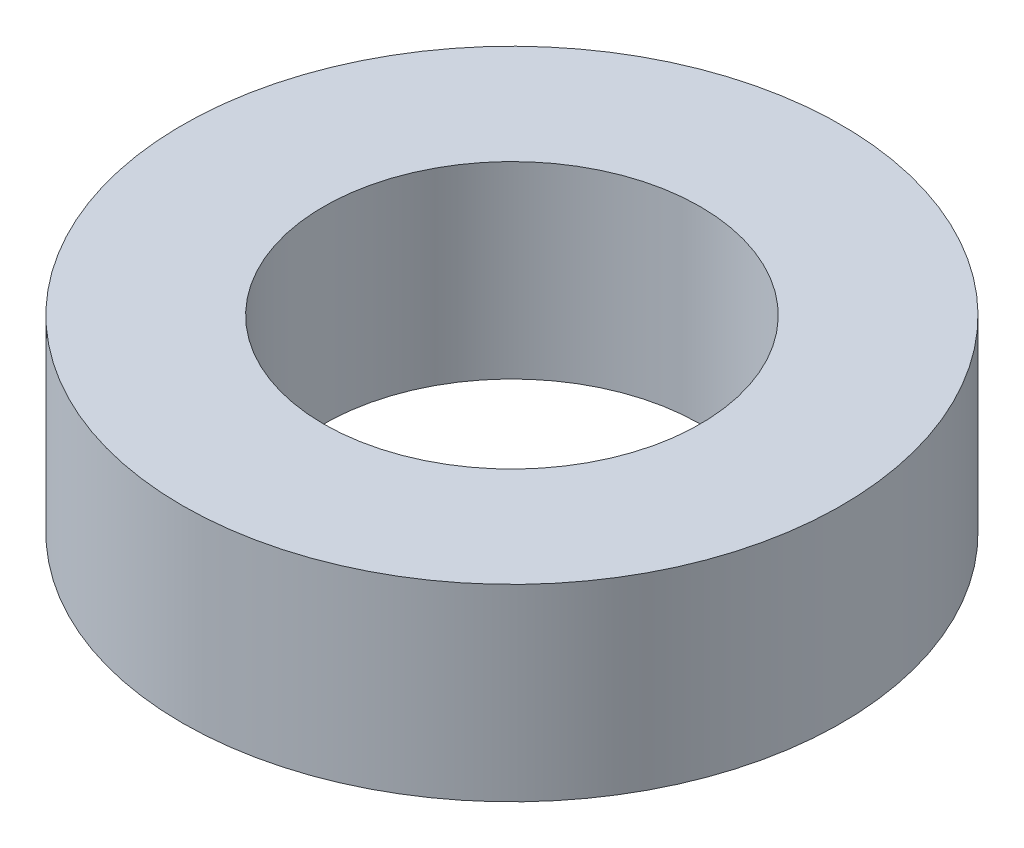
ISO-10303-21;
HEADER;
FILE_DESCRIPTION(('STEP AP214'),'2;1');
FILE_NAME('part.step','',(''),(''),'','','');
FILE_SCHEMA(('AUTOMOTIVE_DESIGN { 1 0 10303 214 1 1 1 1 }'));
ENDSEC;
DATA;
#1=APPLICATION_CONTEXT('core data for automotive mechanical design processes');
#2=APPLICATION_PROTOCOL_DEFINITION('international standard','automotive_design',2000,#1);
#3=PRODUCT_CONTEXT('',#1,'mechanical');
#4=PRODUCT('Part','Part','',(#3));
#5=PRODUCT_RELATED_PRODUCT_CATEGORY('part','',(#4));
#6=PRODUCT_DEFINITION_FORMATION('','',#4);
#7=PRODUCT_DEFINITION_CONTEXT('part definition',#1,'design');
#8=PRODUCT_DEFINITION('design','',#6,#7);
#9=PRODUCT_DEFINITION_SHAPE('','',#8);
#10=(LENGTH_UNIT() NAMED_UNIT(*) SI_UNIT(.MILLI.,.METRE.));
#11=(NAMED_UNIT(*) PLANE_ANGLE_UNIT() SI_UNIT($,.RADIAN.));
#12=(NAMED_UNIT(*) SI_UNIT($,.STERADIAN.) SOLID_ANGLE_UNIT());
#13=UNCERTAINTY_MEASURE_WITH_UNIT(LENGTH_MEASURE(1.E-05),#10,'distance_accuracy_value','');
#14=(GEOMETRIC_REPRESENTATION_CONTEXT(3) GLOBAL_UNCERTAINTY_ASSIGNED_CONTEXT((#13)) GLOBAL_UNIT_ASSIGNED_CONTEXT((#10,
#11,#12)) REPRESENTATION_CONTEXT('',''));
#15=CARTESIAN_POINT('',(0.,0.,0.));
#16=DIRECTION('',(0.,0.,1.));
#17=DIRECTION('',(1.,0.,0.));
#18=AXIS2_PLACEMENT_3D('',#15,#16,#17);
#19=CARTESIAN_POINT('',(0.,6.35,0.));
#20=DIRECTION('',(0.,1.,0.));
#21=DIRECTION('',(0.,0.,1.));
#22=AXIS2_PLACEMENT_3D('',#19,#20,#21);
#23=PLANE('',#22);
#24=CARTESIAN_POINT('',(0.,6.35,0.));
#25=DIRECTION('',(0.,1.,0.));
#26=DIRECTION('',(0.,0.,1.));
#27=AXIS2_PLACEMENT_3D('',#24,#25,#26);
#28=CIRCLE('',#27,11.1125);
#29=CARTESIAN_POINT('',(0.,6.35,11.1125));
#30=VERTEX_POINT('',#29);
#31=EDGE_CURVE('E10',#30,#30,#28,.T.);
#32=ORIENTED_EDGE('',*,*,#31,.T.);
#33=EDGE_LOOP('',(#32));
#34=FACE_BOUND('',#33,.T.);
#35=CARTESIAN_POINT('',(0.,6.35,0.));
#36=DIRECTION('',(0.,1.,0.));
#37=DIRECTION('',(0.,0.,1.));
#38=AXIS2_PLACEMENT_3D('',#35,#36,#37);
#39=CIRCLE('',#38,6.35);
#40=CARTESIAN_POINT('',(0.,6.35,6.35));
#41=VERTEX_POINT('',#40);
#42=EDGE_CURVE('E41',#41,#41,#39,.T.);
#43=ORIENTED_EDGE('',*,*,#42,.F.);
#44=EDGE_LOOP('',(#43));
#45=FACE_BOUND('',#44,.T.);
#46=ADVANCED_FACE('F30',(#34,#45),#23,.T.);
#47=CARTESIAN_POINT('',(0.,0.,0.));
#48=DIRECTION('',(0.,1.,0.));
#49=DIRECTION('',(0.,0.,1.));
#50=AXIS2_PLACEMENT_3D('',#47,#48,#49);
#51=PLANE('',#50);
#52=CARTESIAN_POINT('',(0.,0.,0.));
#53=DIRECTION('',(0.,1.,0.));
#54=DIRECTION('',(0.,0.,1.));
#55=AXIS2_PLACEMENT_3D('',#52,#53,#54);
#56=CIRCLE('',#55,11.1125);
#57=CARTESIAN_POINT('',(0.,0.,11.1125));
#58=VERTEX_POINT('',#57);
#59=EDGE_CURVE('E34',#58,#58,#56,.T.);
#60=ORIENTED_EDGE('',*,*,#59,.F.);
#61=EDGE_LOOP('',(#60));
#62=FACE_BOUND('',#61,.T.);
#63=CARTESIAN_POINT('',(0.,0.,0.));
#64=DIRECTION('',(0.,1.,0.));
#65=DIRECTION('',(0.,0.,1.));
#66=AXIS2_PLACEMENT_3D('',#63,#64,#65);
#67=CIRCLE('',#66,6.35);
#68=CARTESIAN_POINT('',(0.,0.,6.35));
#69=VERTEX_POINT('',#68);
#70=EDGE_CURVE('E43',#69,#69,#67,.T.);
#71=ORIENTED_EDGE('',*,*,#70,.T.);
#72=EDGE_LOOP('',(#71));
#73=FACE_BOUND('',#72,.T.);
#74=ADVANCED_FACE('F53',(#62,#73),#51,.F.);
#75=CARTESIAN_POINT('',(0.,6.35,0.));
#76=DIRECTION('',(0.,-1.,0.));
#77=DIRECTION('',(0.,0.,-1.));
#78=AXIS2_PLACEMENT_3D('',#75,#76,#77);
#79=CYLINDRICAL_SURFACE('',#78,11.1125);
#80=ORIENTED_EDGE('',*,*,#31,.F.);
#81=EDGE_LOOP('',(#80));
#82=FACE_BOUND('',#81,.T.);
#83=ORIENTED_EDGE('',*,*,#59,.T.);
#84=EDGE_LOOP('',(#83));
#85=FACE_BOUND('',#84,.T.);
#86=ADVANCED_FACE('F32',(#82,#85),#79,.T.);
#87=CARTESIAN_POINT('',(0.,6.35,0.));
#88=DIRECTION('',(0.,-1.,0.));
#89=DIRECTION('',(0.,0.,-1.));
#90=AXIS2_PLACEMENT_3D('',#87,#88,#89);
#91=CYLINDRICAL_SURFACE('',#90,6.35);
#92=ORIENTED_EDGE('',*,*,#42,.T.);
#93=EDGE_LOOP('',(#92));
#94=FACE_BOUND('',#93,.T.);
#95=ORIENTED_EDGE('',*,*,#70,.F.);
#96=EDGE_LOOP('',(#95));
#97=FACE_BOUND('',#96,.T.);
#98=ADVANCED_FACE('F49',(#94,#97),#91,.F.);
#99=CLOSED_SHELL('',(#46,#74,#86,#98));
#100=MANIFOLD_SOLID_BREP('B2',#99);
#101=ADVANCED_BREP_SHAPE_REPRESENTATION('',(#18,#100),#14);
#102=SHAPE_DEFINITION_REPRESENTATION(#9,#101);
ENDSEC;
END-ISO-10303-21;
